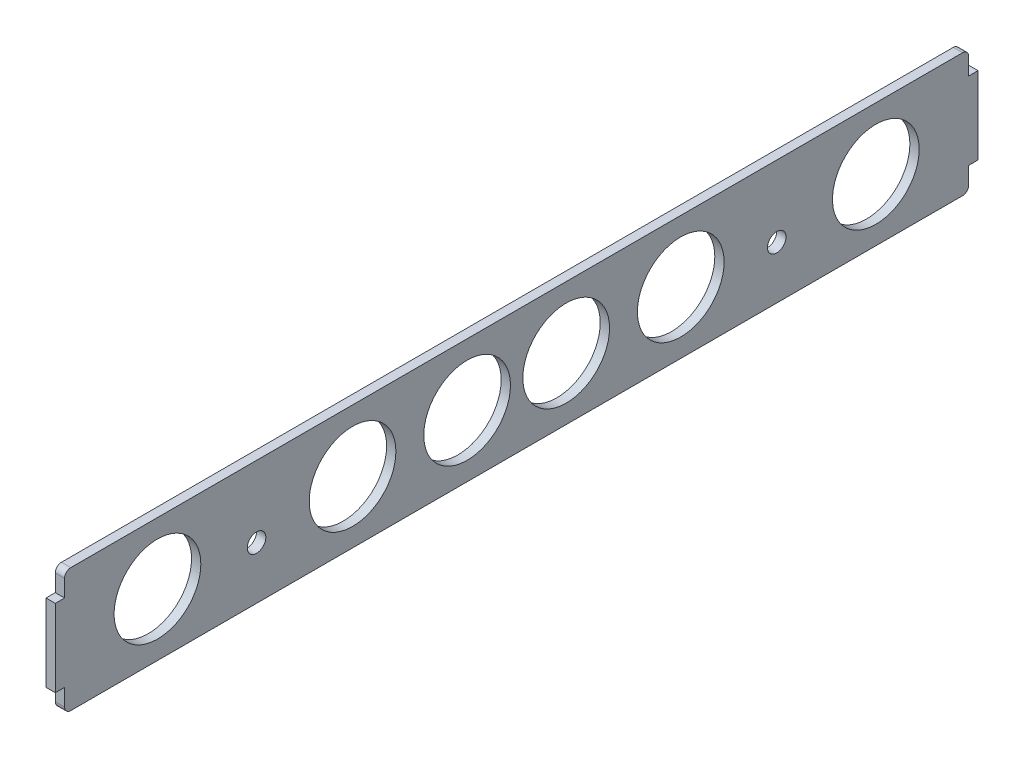
ISO-10303-21;
HEADER;
FILE_DESCRIPTION(('STEP AP214'),'2;1');
FILE_NAME('part.step','',(''),(''),'','','');
FILE_SCHEMA(('AUTOMOTIVE_DESIGN { 1 0 10303 214 1 1 1 1 }'));
ENDSEC;
DATA;
#1=APPLICATION_CONTEXT('core data for automotive mechanical design processes');
#2=APPLICATION_PROTOCOL_DEFINITION('international standard','automotive_design',2000,#1);
#3=PRODUCT_CONTEXT('',#1,'mechanical');
#4=PRODUCT('Part','Part','',(#3));
#5=PRODUCT_RELATED_PRODUCT_CATEGORY('part','',(#4));
#6=PRODUCT_DEFINITION_FORMATION('','',#4);
#7=PRODUCT_DEFINITION_CONTEXT('part definition',#1,'design');
#8=PRODUCT_DEFINITION('design','',#6,#7);
#9=PRODUCT_DEFINITION_SHAPE('','',#8);
#10=(LENGTH_UNIT() NAMED_UNIT(*) SI_UNIT(.MILLI.,.METRE.));
#11=(NAMED_UNIT(*) PLANE_ANGLE_UNIT() SI_UNIT($,.RADIAN.));
#12=(NAMED_UNIT(*) SI_UNIT($,.STERADIAN.) SOLID_ANGLE_UNIT());
#13=UNCERTAINTY_MEASURE_WITH_UNIT(LENGTH_MEASURE(1.E-05),#10,'distance_accuracy_value','');
#14=(GEOMETRIC_REPRESENTATION_CONTEXT(3) GLOBAL_UNCERTAINTY_ASSIGNED_CONTEXT((#13)) GLOBAL_UNIT_ASSIGNED_CONTEXT((#10,
#11,#12)) REPRESENTATION_CONTEXT('',''));
#15=CARTESIAN_POINT('',(0.,0.,0.));
#16=DIRECTION('',(0.,0.,1.));
#17=DIRECTION('',(1.,0.,0.));
#18=AXIS2_PLACEMENT_3D('',#15,#16,#17);
#19=CARTESIAN_POINT('',(3.,0.,-292.));
#20=DIRECTION('',(0.,0.,-1.));
#21=DIRECTION('',(-1.,0.,0.));
#22=AXIS2_PLACEMENT_3D('',#19,#20,#21);
#23=PLANE('',#22);
#24=DIRECTION('',(1.,0.,0.));
#25=VECTOR('',#24,1.);
#26=CARTESIAN_POINT('',(0.,-7.50000000000001,-292.));
#27=LINE('',#26,#25);
#28=CARTESIAN_POINT('',(0.,-7.50000000000001,-292.));
#29=VERTEX_POINT('',#28);
#30=CARTESIAN_POINT('',(3.,-7.50000000000001,-292.));
#31=VERTEX_POINT('',#30);
#32=EDGE_CURVE('E193',#29,#31,#27,.T.);
#33=ORIENTED_EDGE('',*,*,#32,.F.);
#34=DIRECTION('',(0.,-1.,0.));
#35=VECTOR('',#34,1.);
#36=CARTESIAN_POINT('',(0.,0.,-292.));
#37=LINE('',#36,#35);
#38=CARTESIAN_POINT('',(0.,-2.,-292.));
#39=VERTEX_POINT('',#38);
#40=EDGE_CURVE('E297',#39,#29,#37,.T.);
#41=ORIENTED_EDGE('',*,*,#40,.F.);
#42=DIRECTION('',(-1.,0.,0.));
#43=VECTOR('',#42,1.);
#44=CARTESIAN_POINT('',(3.,-2.,-292.));
#45=LINE('',#44,#43);
#46=CARTESIAN_POINT('',(3.,-2.,-292.));
#47=VERTEX_POINT('',#46);
#48=EDGE_CURVE('E333',#39,#47,#45,.F.);
#49=ORIENTED_EDGE('',*,*,#48,.T.);
#50=DIRECTION('',(0.,-1.,0.));
#51=VECTOR('',#50,1.);
#52=CARTESIAN_POINT('',(3.,0.,-292.));
#53=LINE('',#52,#51);
#54=EDGE_CURVE('E271',#47,#31,#53,.T.);
#55=ORIENTED_EDGE('',*,*,#54,.T.);
#56=EDGE_LOOP('',(#33,#41,#49,#55));
#57=FACE_BOUND('',#56,.T.);
#58=ADVANCED_FACE('F41',(#57),#23,.T.);
#59=CARTESIAN_POINT('',(3.,0.,0.));
#60=DIRECTION('',(0.,0.,-1.));
#61=DIRECTION('',(-1.,0.,0.));
#62=AXIS2_PLACEMENT_3D('',#59,#60,#61);
#63=PLANE('',#62);
#64=DIRECTION('',(0.,-1.,0.));
#65=VECTOR('',#64,1.);
#66=CARTESIAN_POINT('',(3.,0.,0.));
#67=LINE('',#66,#65);
#68=CARTESIAN_POINT('',(3.,-32.5,0.));
#69=VERTEX_POINT('',#68);
#70=CARTESIAN_POINT('',(3.,-38.,0.));
#71=VERTEX_POINT('',#70);
#72=EDGE_CURVE('E66',#69,#71,#67,.T.);
#73=ORIENTED_EDGE('',*,*,#72,.F.);
#74=DIRECTION('',(1.,0.,0.));
#75=VECTOR('',#74,1.);
#76=CARTESIAN_POINT('',(0.,-32.5,0.));
#77=LINE('',#76,#75);
#78=CARTESIAN_POINT('',(0.,-32.5,0.));
#79=VERTEX_POINT('',#78);
#80=EDGE_CURVE('E225',#79,#69,#77,.T.);
#81=ORIENTED_EDGE('',*,*,#80,.F.);
#82=DIRECTION('',(0.,-1.,0.));
#83=VECTOR('',#82,1.);
#84=CARTESIAN_POINT('',(0.,0.,0.));
#85=LINE('',#84,#83);
#86=CARTESIAN_POINT('',(0.,-38.,0.));
#87=VERTEX_POINT('',#86);
#88=EDGE_CURVE('E303',#79,#87,#85,.T.);
#89=ORIENTED_EDGE('',*,*,#88,.T.);
#90=DIRECTION('',(-1.,0.,0.));
#91=VECTOR('',#90,1.);
#92=CARTESIAN_POINT('',(3.,-38.,0.));
#93=LINE('',#92,#91);
#94=EDGE_CURVE('E11',#87,#71,#93,.F.);
#95=ORIENTED_EDGE('',*,*,#94,.T.);
#96=EDGE_LOOP('',(#73,#81,#89,#95));
#97=FACE_BOUND('',#96,.T.);
#98=ADVANCED_FACE('F401',(#97),#63,.F.);
#99=DIRECTION('',(1.,0.,0.));
#100=VECTOR('',#99,1.);
#101=CARTESIAN_POINT('',(0.,-32.5,-292.));
#102=LINE('',#101,#100);
#103=CARTESIAN_POINT('',(0.,-32.5,-292.));
#104=VERTEX_POINT('',#103);
#105=CARTESIAN_POINT('',(3.,-32.5,-292.));
#106=VERTEX_POINT('',#105);
#107=EDGE_CURVE('E168',#104,#106,#102,.T.);
#108=ORIENTED_EDGE('',*,*,#107,.T.);
#109=CARTESIAN_POINT('',(3.,-38.,-292.));
#110=VERTEX_POINT('',#109);
#111=EDGE_CURVE('E270',#106,#110,#53,.T.);
#112=ORIENTED_EDGE('',*,*,#111,.T.);
#113=DIRECTION('',(-1.,0.,0.));
#114=VECTOR('',#113,1.);
#115=CARTESIAN_POINT('',(0.,-38.,-292.));
#116=LINE('',#115,#114);
#117=CARTESIAN_POINT('',(0.,-38.,-292.));
#118=VERTEX_POINT('',#117);
#119=EDGE_CURVE('E329',#110,#118,#116,.T.);
#120=ORIENTED_EDGE('',*,*,#119,.T.);
#121=EDGE_CURVE('E296',#104,#118,#37,.T.);
#122=ORIENTED_EDGE('',*,*,#121,.F.);
#123=EDGE_LOOP('',(#108,#112,#120,#122));
#124=FACE_BOUND('',#123,.T.);
#125=ADVANCED_FACE('F404',(#124),#23,.T.);
#126=CARTESIAN_POINT('',(3.,0.,0.));
#127=DIRECTION('',(0.,1.,0.));
#128=DIRECTION('',(0.,0.,1.));
#129=AXIS2_PLACEMENT_3D('',#126,#127,#128);
#130=PLANE('',#129);
#131=DIRECTION('',(0.,0.,-1.));
#132=VECTOR('',#131,1.);
#133=CARTESIAN_POINT('',(3.,0.,0.));
#134=LINE('',#133,#132);
#135=CARTESIAN_POINT('',(3.,0.,-2.));
#136=VERTEX_POINT('',#135);
#137=CARTESIAN_POINT('',(3.,0.,-290.));
#138=VERTEX_POINT('',#137);
#139=EDGE_CURVE('E275',#136,#138,#134,.T.);
#140=ORIENTED_EDGE('',*,*,#139,.T.);
#141=DIRECTION('',(-1.,0.,0.));
#142=VECTOR('',#141,1.);
#143=CARTESIAN_POINT('',(3.,0.,-290.));
#144=LINE('',#143,#142);
#145=CARTESIAN_POINT('',(0.,0.,-290.));
#146=VERTEX_POINT('',#145);
#147=EDGE_CURVE('E312',#138,#146,#144,.T.);
#148=ORIENTED_EDGE('',*,*,#147,.T.);
#149=DIRECTION('',(0.,0.,-1.));
#150=VECTOR('',#149,1.);
#151=CARTESIAN_POINT('',(0.,0.,0.));
#152=LINE('',#151,#150);
#153=CARTESIAN_POINT('',(0.,0.,-2.));
#154=VERTEX_POINT('',#153);
#155=EDGE_CURVE('E300',#154,#146,#152,.T.);
#156=ORIENTED_EDGE('',*,*,#155,.F.);
#157=DIRECTION('',(-1.,0.,0.));
#158=VECTOR('',#157,1.);
#159=CARTESIAN_POINT('',(3.,0.,-2.));
#160=LINE('',#159,#158);
#161=EDGE_CURVE('E287',#154,#136,#160,.F.);
#162=ORIENTED_EDGE('',*,*,#161,.T.);
#163=EDGE_LOOP('',(#140,#148,#156,#162));
#164=FACE_BOUND('',#163,.T.);
#165=ADVANCED_FACE('F414',(#164),#130,.T.);
#166=CARTESIAN_POINT('',(0.,-2.,0.));
#167=VERTEX_POINT('',#166);
#168=CARTESIAN_POINT('',(0.,-7.5,0.));
#169=VERTEX_POINT('',#168);
#170=EDGE_CURVE('E304',#167,#169,#85,.T.);
#171=ORIENTED_EDGE('',*,*,#170,.T.);
#172=DIRECTION('',(1.,0.,0.));
#173=VECTOR('',#172,1.);
#174=CARTESIAN_POINT('',(0.,-7.5,0.));
#175=LINE('',#174,#173);
#176=CARTESIAN_POINT('',(3.,-7.5,0.));
#177=VERTEX_POINT('',#176);
#178=EDGE_CURVE('E214',#169,#177,#175,.T.);
#179=ORIENTED_EDGE('',*,*,#178,.T.);
#180=CARTESIAN_POINT('',(3.,-2.,0.));
#181=VERTEX_POINT('',#180);
#182=EDGE_CURVE('E279',#181,#177,#67,.T.);
#183=ORIENTED_EDGE('',*,*,#182,.F.);
#184=DIRECTION('',(-1.,0.,0.));
#185=VECTOR('',#184,1.);
#186=CARTESIAN_POINT('',(0.,-2.,0.));
#187=LINE('',#186,#185);
#188=EDGE_CURVE('E51',#181,#167,#187,.T.);
#189=ORIENTED_EDGE('',*,*,#188,.T.);
#190=EDGE_LOOP('',(#171,#179,#183,#189));
#191=FACE_BOUND('',#190,.T.);
#192=ADVANCED_FACE('F409',(#191),#63,.F.);
#193=CARTESIAN_POINT('',(3.,-23.,-62.));
#194=DIRECTION('',(-1.,0.,0.));
#195=DIRECTION('',(0.,0.,1.));
#196=AXIS2_PLACEMENT_3D('',#193,#194,#195);
#197=CYLINDRICAL_SURFACE('',#196,3.00000000000001);
#198=CARTESIAN_POINT('',(3.,-23.,-62.));
#199=DIRECTION('',(1.,0.,0.));
#200=DIRECTION('',(0.,0.,-1.));
#201=AXIS2_PLACEMENT_3D('',#198,#199,#200);
#202=CIRCLE('',#201,3.00000000000001);
#203=CARTESIAN_POINT('',(3.,-23.,-65.));
#204=VERTEX_POINT('',#203);
#205=EDGE_CURVE('E265',#204,#204,#202,.T.);
#206=ORIENTED_EDGE('',*,*,#205,.T.);
#207=EDGE_LOOP('',(#206));
#208=FACE_BOUND('',#207,.T.);
#209=CARTESIAN_POINT('',(0.,-23.,-62.));
#210=DIRECTION('',(1.,0.,0.));
#211=DIRECTION('',(0.,0.,-1.));
#212=AXIS2_PLACEMENT_3D('',#209,#210,#211);
#213=CIRCLE('',#212,3.00000000000001);
#214=CARTESIAN_POINT('',(0.,-23.,-65.));
#215=VERTEX_POINT('',#214);
#216=EDGE_CURVE('E292',#215,#215,#213,.T.);
#217=ORIENTED_EDGE('',*,*,#216,.F.);
#218=EDGE_LOOP('',(#217));
#219=FACE_BOUND('',#218,.T.);
#220=ADVANCED_FACE('F543',(#208,#219),#197,.F.);
#221=CARTESIAN_POINT('',(3.,-23.,-230.));
#222=DIRECTION('',(-1.,0.,0.));
#223=DIRECTION('',(0.,0.,1.));
#224=AXIS2_PLACEMENT_3D('',#221,#222,#223);
#225=CYLINDRICAL_SURFACE('',#224,2.99999999999999);
#226=CARTESIAN_POINT('',(3.,-23.,-230.));
#227=DIRECTION('',(1.,0.,0.));
#228=DIRECTION('',(0.,0.,-1.));
#229=AXIS2_PLACEMENT_3D('',#226,#227,#228);
#230=CIRCLE('',#229,2.99999999999999);
#231=CARTESIAN_POINT('',(3.,-23.,-233.));
#232=VERTEX_POINT('',#231);
#233=EDGE_CURVE('E261',#232,#232,#230,.T.);
#234=ORIENTED_EDGE('',*,*,#233,.T.);
#235=EDGE_LOOP('',(#234));
#236=FACE_BOUND('',#235,.T.);
#237=CARTESIAN_POINT('',(0.,-23.,-230.));
#238=DIRECTION('',(1.,0.,0.));
#239=DIRECTION('',(0.,0.,-1.));
#240=AXIS2_PLACEMENT_3D('',#237,#238,#239);
#241=CIRCLE('',#240,2.99999999999999);
#242=CARTESIAN_POINT('',(0.,-23.,-233.));
#243=VERTEX_POINT('',#242);
#244=EDGE_CURVE('E288',#243,#243,#241,.T.);
#245=ORIENTED_EDGE('',*,*,#244,.F.);
#246=EDGE_LOOP('',(#245));
#247=FACE_BOUND('',#246,.T.);
#248=ADVANCED_FACE('F646',(#236,#247),#225,.F.);
#249=CARTESIAN_POINT('',(3.,-40.,0.));
#250=DIRECTION('',(0.,1.,0.));
#251=DIRECTION('',(0.,0.,1.));
#252=AXIS2_PLACEMENT_3D('',#249,#250,#251);
#253=PLANE('',#252);
#254=DIRECTION('',(0.,0.,-1.));
#255=VECTOR('',#254,1.);
#256=CARTESIAN_POINT('',(0.,-40.,0.));
#257=LINE('',#256,#255);
#258=CARTESIAN_POINT('',(0.,-40.,-2.));
#259=VERTEX_POINT('',#258);
#260=CARTESIAN_POINT('',(0.,-40.,-290.));
#261=VERTEX_POINT('',#260);
#262=EDGE_CURVE('E266',#259,#261,#257,.T.);
#263=ORIENTED_EDGE('',*,*,#262,.T.);
#264=DIRECTION('',(-1.,0.,0.));
#265=VECTOR('',#264,1.);
#266=CARTESIAN_POINT('',(3.,-40.,-290.));
#267=LINE('',#266,#265);
#268=CARTESIAN_POINT('',(3.,-40.,-290.));
#269=VERTEX_POINT('',#268);
#270=EDGE_CURVE('E353',#261,#269,#267,.F.);
#271=ORIENTED_EDGE('',*,*,#270,.T.);
#272=DIRECTION('',(0.,0.,-1.));
#273=VECTOR('',#272,1.);
#274=CARTESIAN_POINT('',(3.,-40.,0.));
#275=LINE('',#274,#273);
#276=CARTESIAN_POINT('',(3.,-40.,-2.));
#277=VERTEX_POINT('',#276);
#278=EDGE_CURVE('E283',#277,#269,#275,.T.);
#279=ORIENTED_EDGE('',*,*,#278,.F.);
#280=DIRECTION('',(-1.,0.,0.));
#281=VECTOR('',#280,1.);
#282=CARTESIAN_POINT('',(3.,-40.,-2.));
#283=LINE('',#282,#281);
#284=EDGE_CURVE('E349',#277,#259,#283,.T.);
#285=ORIENTED_EDGE('',*,*,#284,.T.);
#286=EDGE_LOOP('',(#263,#271,#279,#285));
#287=FACE_BOUND('',#286,.T.);
#288=ADVANCED_FACE('F436',(#287),#253,.F.);
#289=CARTESIAN_POINT('',(3.,0.,0.));
#290=DIRECTION('',(1.,0.,0.));
#291=DIRECTION('',(0.,0.,-1.));
#292=AXIS2_PLACEMENT_3D('',#289,#290,#291);
#293=PLANE('',#292);
#294=CARTESIAN_POINT('',(3.,-20.,-30.));
#295=DIRECTION('',(1.,0.,0.));
#296=DIRECTION('',(0.,0.,-1.));
#297=AXIS2_PLACEMENT_3D('',#294,#295,#296);
#298=CIRCLE('',#297,14.);
#299=CARTESIAN_POINT('',(3.,-20.,-44.));
#300=VERTEX_POINT('',#299);
#301=EDGE_CURVE('E237',#300,#300,#298,.T.);
#302=ORIENTED_EDGE('',*,*,#301,.F.);
#303=EDGE_LOOP('',(#302));
#304=FACE_BOUND('',#303,.T.);
#305=CARTESIAN_POINT('',(3.,-20.,-93.));
#306=DIRECTION('',(1.,0.,0.));
#307=DIRECTION('',(0.,0.,-1.));
#308=AXIS2_PLACEMENT_3D('',#305,#306,#307);
#309=CIRCLE('',#308,14.);
#310=CARTESIAN_POINT('',(3.,-20.,-107.));
#311=VERTEX_POINT('',#310);
#312=EDGE_CURVE('E242',#311,#311,#309,.T.);
#313=ORIENTED_EDGE('',*,*,#312,.F.);
#314=EDGE_LOOP('',(#313));
#315=FACE_BOUND('',#314,.T.);
#316=CARTESIAN_POINT('',(3.,-20.,-130.));
#317=DIRECTION('',(1.,0.,0.));
#318=DIRECTION('',(0.,0.,-1.));
#319=AXIS2_PLACEMENT_3D('',#316,#317,#318);
#320=CIRCLE('',#319,14.);
#321=CARTESIAN_POINT('',(3.,-20.,-144.));
#322=VERTEX_POINT('',#321);
#323=EDGE_CURVE('E246',#322,#322,#320,.T.);
#324=ORIENTED_EDGE('',*,*,#323,.F.);
#325=EDGE_LOOP('',(#324));
#326=FACE_BOUND('',#325,.T.);
#327=CARTESIAN_POINT('',(3.,-20.,-199.));
#328=DIRECTION('',(1.,0.,0.));
#329=DIRECTION('',(0.,0.,-1.));
#330=AXIS2_PLACEMENT_3D('',#327,#328,#329);
#331=CIRCLE('',#330,14.);
#332=CARTESIAN_POINT('',(3.,-20.,-213.));
#333=VERTEX_POINT('',#332);
#334=EDGE_CURVE('E250',#333,#333,#331,.T.);
#335=ORIENTED_EDGE('',*,*,#334,.F.);
#336=EDGE_LOOP('',(#335));
#337=FACE_BOUND('',#336,.T.);
#338=CARTESIAN_POINT('',(3.,-20.,-162.));
#339=DIRECTION('',(1.,0.,0.));
#340=DIRECTION('',(0.,0.,-1.));
#341=AXIS2_PLACEMENT_3D('',#338,#339,#340);
#342=CIRCLE('',#341,14.);
#343=CARTESIAN_POINT('',(3.,-20.,-176.));
#344=VERTEX_POINT('',#343);
#345=EDGE_CURVE('E254',#344,#344,#342,.T.);
#346=ORIENTED_EDGE('',*,*,#345,.F.);
#347=EDGE_LOOP('',(#346));
#348=FACE_BOUND('',#347,.T.);
#349=CARTESIAN_POINT('',(3.,-20.,-262.));
#350=DIRECTION('',(1.,0.,0.));
#351=DIRECTION('',(0.,0.,-1.));
#352=AXIS2_PLACEMENT_3D('',#349,#350,#351);
#353=CIRCLE('',#352,14.);
#354=CARTESIAN_POINT('',(3.,-20.,-276.));
#355=VERTEX_POINT('',#354);
#356=EDGE_CURVE('E228',#355,#355,#353,.T.);
#357=ORIENTED_EDGE('',*,*,#356,.F.);
#358=EDGE_LOOP('',(#357));
#359=FACE_BOUND('',#358,.T.);
#360=ORIENTED_EDGE('',*,*,#233,.F.);
#361=EDGE_LOOP('',(#360));
#362=FACE_BOUND('',#361,.T.);
#363=ORIENTED_EDGE('',*,*,#205,.F.);
#364=EDGE_LOOP('',(#363));
#365=FACE_BOUND('',#364,.T.);
#366=ORIENTED_EDGE('',*,*,#54,.F.);
#367=CARTESIAN_POINT('',(3.,-2.,-290.));
#368=DIRECTION('',(1.,0.,0.));
#369=DIRECTION('',(0.,0.,-1.));
#370=AXIS2_PLACEMENT_3D('',#367,#368,#369);
#371=CIRCLE('',#370,2.);
#372=EDGE_CURVE('E346',#47,#138,#371,.T.);
#373=ORIENTED_EDGE('',*,*,#372,.T.);
#374=ORIENTED_EDGE('',*,*,#139,.F.);
#375=CARTESIAN_POINT('',(3.,-2.,-2.));
#376=DIRECTION('',(1.,0.,0.));
#377=DIRECTION('',(0.,0.,-1.));
#378=AXIS2_PLACEMENT_3D('',#375,#376,#377);
#379=CIRCLE('',#378,2.);
#380=EDGE_CURVE('E336',#136,#181,#379,.T.);
#381=ORIENTED_EDGE('',*,*,#380,.T.);
#382=ORIENTED_EDGE('',*,*,#182,.T.);
#383=DIRECTION('',(0.,0.,1.));
#384=VECTOR('',#383,1.);
#385=CARTESIAN_POINT('',(3.,-7.5,0.));
#386=LINE('',#385,#384);
#387=CARTESIAN_POINT('',(3.,-7.5,2.99999999999999));
#388=VERTEX_POINT('',#387);
#389=EDGE_CURVE('E196',#177,#388,#386,.T.);
#390=ORIENTED_EDGE('',*,*,#389,.T.);
#391=DIRECTION('',(0.,-1.,0.));
#392=VECTOR('',#391,1.);
#393=CARTESIAN_POINT('',(3.,-7.5,2.99999999999999));
#394=LINE('',#393,#392);
#395=CARTESIAN_POINT('',(3.,-32.5,3.));
#396=VERTEX_POINT('',#395);
#397=EDGE_CURVE('E218',#388,#396,#394,.T.);
#398=ORIENTED_EDGE('',*,*,#397,.T.);
#399=DIRECTION('',(0.,0.,-1.));
#400=VECTOR('',#399,1.);
#401=CARTESIAN_POINT('',(3.,-32.5,0.));
#402=LINE('',#401,#400);
#403=EDGE_CURVE('E206',#396,#69,#402,.T.);
#404=ORIENTED_EDGE('',*,*,#403,.T.);
#405=ORIENTED_EDGE('',*,*,#72,.T.);
#406=CARTESIAN_POINT('',(3.,-38.,-2.));
#407=DIRECTION('',(1.,0.,0.));
#408=DIRECTION('',(0.,0.,-1.));
#409=AXIS2_PLACEMENT_3D('',#406,#407,#408);
#410=CIRCLE('',#409,2.);
#411=EDGE_CURVE('E339',#71,#277,#410,.T.);
#412=ORIENTED_EDGE('',*,*,#411,.T.);
#413=ORIENTED_EDGE('',*,*,#278,.T.);
#414=CARTESIAN_POINT('',(3.,-38.,-290.));
#415=DIRECTION('',(1.,0.,0.));
#416=DIRECTION('',(0.,0.,-1.));
#417=AXIS2_PLACEMENT_3D('',#414,#415,#416);
#418=CIRCLE('',#417,2.);
#419=EDGE_CURVE('E342',#269,#110,#418,.T.);
#420=ORIENTED_EDGE('',*,*,#419,.T.);
#421=ORIENTED_EDGE('',*,*,#111,.F.);
#422=DIRECTION('',(0.,0.,-1.));
#423=VECTOR('',#422,1.);
#424=CARTESIAN_POINT('',(3.,-32.5,-292.));
#425=LINE('',#424,#423);
#426=CARTESIAN_POINT('',(3.,-32.5,-295.));
#427=VERTEX_POINT('',#426);
#428=EDGE_CURVE('E188',#106,#427,#425,.T.);
#429=ORIENTED_EDGE('',*,*,#428,.T.);
#430=DIRECTION('',(0.,1.,0.));
#431=VECTOR('',#430,1.);
#432=CARTESIAN_POINT('',(3.,-7.5,-295.));
#433=LINE('',#432,#431);
#434=CARTESIAN_POINT('',(3.,-7.5,-295.));
#435=VERTEX_POINT('',#434);
#436=EDGE_CURVE('E163',#427,#435,#433,.T.);
#437=ORIENTED_EDGE('',*,*,#436,.T.);
#438=DIRECTION('',(0.,0.,1.));
#439=VECTOR('',#438,1.);
#440=CARTESIAN_POINT('',(3.,-7.50000000000001,-292.));
#441=LINE('',#440,#439);
#442=EDGE_CURVE('E180',#435,#31,#441,.T.);
#443=ORIENTED_EDGE('',*,*,#442,.T.);
#444=EDGE_LOOP('',(#366,#373,#374,#381,#382,#390,#398,#404,#405,#412,#413,#420,#421,#429,#437,#443));
#445=FACE_BOUND('',#444,.T.);
#446=ADVANCED_FACE('F423',(#304,#315,#326,#337,#348,#359,#362,#365,#445),#293,.T.);
#447=CARTESIAN_POINT('',(0.,0.,0.));
#448=DIRECTION('',(1.,0.,0.));
#449=DIRECTION('',(0.,0.,-1.));
#450=AXIS2_PLACEMENT_3D('',#447,#448,#449);
#451=PLANE('',#450);
#452=CARTESIAN_POINT('',(0.,-20.,-30.));
#453=DIRECTION('',(1.,0.,0.));
#454=DIRECTION('',(0.,0.,-1.));
#455=AXIS2_PLACEMENT_3D('',#452,#453,#454);
#456=CIRCLE('',#455,14.);
#457=CARTESIAN_POINT('',(0.,-20.,-44.));
#458=VERTEX_POINT('',#457);
#459=EDGE_CURVE('E45',#458,#458,#456,.T.);
#460=ORIENTED_EDGE('',*,*,#459,.T.);
#461=EDGE_LOOP('',(#460));
#462=FACE_BOUND('',#461,.T.);
#463=CARTESIAN_POINT('',(0.,-20.,-93.));
#464=DIRECTION('',(1.,0.,0.));
#465=DIRECTION('',(0.,0.,-1.));
#466=AXIS2_PLACEMENT_3D('',#463,#464,#465);
#467=CIRCLE('',#466,14.);
#468=CARTESIAN_POINT('',(0.,-20.,-107.));
#469=VERTEX_POINT('',#468);
#470=EDGE_CURVE('E373',#469,#469,#467,.T.);
#471=ORIENTED_EDGE('',*,*,#470,.T.);
#472=EDGE_LOOP('',(#471));
#473=FACE_BOUND('',#472,.T.);
#474=CARTESIAN_POINT('',(0.,-20.,-130.));
#475=DIRECTION('',(1.,0.,0.));
#476=DIRECTION('',(0.,0.,-1.));
#477=AXIS2_PLACEMENT_3D('',#474,#475,#476);
#478=CIRCLE('',#477,14.);
#479=CARTESIAN_POINT('',(0.,-20.,-144.));
#480=VERTEX_POINT('',#479);
#481=EDGE_CURVE('E370',#480,#480,#478,.T.);
#482=ORIENTED_EDGE('',*,*,#481,.T.);
#483=EDGE_LOOP('',(#482));
#484=FACE_BOUND('',#483,.T.);
#485=CARTESIAN_POINT('',(0.,-20.,-199.));
#486=DIRECTION('',(1.,0.,0.));
#487=DIRECTION('',(0.,0.,-1.));
#488=AXIS2_PLACEMENT_3D('',#485,#486,#487);
#489=CIRCLE('',#488,14.);
#490=CARTESIAN_POINT('',(0.,-20.,-213.));
#491=VERTEX_POINT('',#490);
#492=EDGE_CURVE('E366',#491,#491,#489,.T.);
#493=ORIENTED_EDGE('',*,*,#492,.T.);
#494=EDGE_LOOP('',(#493));
#495=FACE_BOUND('',#494,.T.);
#496=CARTESIAN_POINT('',(0.,-20.,-162.));
#497=DIRECTION('',(1.,0.,0.));
#498=DIRECTION('',(0.,0.,-1.));
#499=AXIS2_PLACEMENT_3D('',#496,#497,#498);
#500=CIRCLE('',#499,14.);
#501=CARTESIAN_POINT('',(0.,-20.,-176.));
#502=VERTEX_POINT('',#501);
#503=EDGE_CURVE('E362',#502,#502,#500,.T.);
#504=ORIENTED_EDGE('',*,*,#503,.T.);
#505=EDGE_LOOP('',(#504));
#506=FACE_BOUND('',#505,.T.);
#507=CARTESIAN_POINT('',(0.,-20.,-262.));
#508=DIRECTION('',(1.,0.,0.));
#509=DIRECTION('',(0.,0.,-1.));
#510=AXIS2_PLACEMENT_3D('',#507,#508,#509);
#511=CIRCLE('',#510,14.);
#512=CARTESIAN_POINT('',(0.,-20.,-276.));
#513=VERTEX_POINT('',#512);
#514=EDGE_CURVE('E241',#513,#513,#511,.T.);
#515=ORIENTED_EDGE('',*,*,#514,.T.);
#516=EDGE_LOOP('',(#515));
#517=FACE_BOUND('',#516,.T.);
#518=ORIENTED_EDGE('',*,*,#244,.T.);
#519=EDGE_LOOP('',(#518));
#520=FACE_BOUND('',#519,.T.);
#521=ORIENTED_EDGE('',*,*,#216,.T.);
#522=EDGE_LOOP('',(#521));
#523=FACE_BOUND('',#522,.T.);
#524=ORIENTED_EDGE('',*,*,#155,.T.);
#525=CARTESIAN_POINT('',(0.,-2.,-290.));
#526=DIRECTION('',(1.,0.,0.));
#527=DIRECTION('',(0.,0.,-1.));
#528=AXIS2_PLACEMENT_3D('',#525,#526,#527);
#529=CIRCLE('',#528,2.);
#530=EDGE_CURVE('E326',#146,#39,#529,.F.);
#531=ORIENTED_EDGE('',*,*,#530,.T.);
#532=ORIENTED_EDGE('',*,*,#40,.T.);
#533=DIRECTION('',(0.,0.,1.));
#534=VECTOR('',#533,1.);
#535=CARTESIAN_POINT('',(0.,-7.50000000000001,-292.));
#536=LINE('',#535,#534);
#537=CARTESIAN_POINT('',(0.,-7.5,-295.));
#538=VERTEX_POINT('',#537);
#539=EDGE_CURVE('E173',#538,#29,#536,.T.);
#540=ORIENTED_EDGE('',*,*,#539,.F.);
#541=DIRECTION('',(0.,1.,0.));
#542=VECTOR('',#541,1.);
#543=CARTESIAN_POINT('',(0.,-7.5,-295.));
#544=LINE('',#543,#542);
#545=CARTESIAN_POINT('',(0.,-32.5,-295.));
#546=VERTEX_POINT('',#545);
#547=EDGE_CURVE('E160',#546,#538,#544,.T.);
#548=ORIENTED_EDGE('',*,*,#547,.F.);
#549=DIRECTION('',(0.,0.,-1.));
#550=VECTOR('',#549,1.);
#551=CARTESIAN_POINT('',(0.,-32.5,-292.));
#552=LINE('',#551,#550);
#553=EDGE_CURVE('E59',#104,#546,#552,.T.);
#554=ORIENTED_EDGE('',*,*,#553,.F.);
#555=ORIENTED_EDGE('',*,*,#121,.T.);
#556=CARTESIAN_POINT('',(0.,-38.,-290.));
#557=DIRECTION('',(1.,0.,0.));
#558=DIRECTION('',(0.,0.,-1.));
#559=AXIS2_PLACEMENT_3D('',#556,#557,#558);
#560=CIRCLE('',#559,2.);
#561=EDGE_CURVE('E323',#118,#261,#560,.F.);
#562=ORIENTED_EDGE('',*,*,#561,.T.);
#563=ORIENTED_EDGE('',*,*,#262,.F.);
#564=CARTESIAN_POINT('',(0.,-38.,-2.));
#565=DIRECTION('',(1.,0.,0.));
#566=DIRECTION('',(0.,0.,-1.));
#567=AXIS2_PLACEMENT_3D('',#564,#565,#566);
#568=CIRCLE('',#567,2.);
#569=EDGE_CURVE('E319',#259,#87,#568,.F.);
#570=ORIENTED_EDGE('',*,*,#569,.T.);
#571=ORIENTED_EDGE('',*,*,#88,.F.);
#572=DIRECTION('',(0.,0.,-1.));
#573=VECTOR('',#572,1.);
#574=CARTESIAN_POINT('',(0.,-32.5,0.));
#575=LINE('',#574,#573);
#576=CARTESIAN_POINT('',(0.,-32.5,3.));
#577=VERTEX_POINT('',#576);
#578=EDGE_CURVE('E210',#577,#79,#575,.T.);
#579=ORIENTED_EDGE('',*,*,#578,.F.);
#580=DIRECTION('',(0.,-1.,0.));
#581=VECTOR('',#580,1.);
#582=CARTESIAN_POINT('',(0.,-7.5,2.99999999999999));
#583=LINE('',#582,#581);
#584=CARTESIAN_POINT('',(0.,-7.5,2.99999999999999));
#585=VERTEX_POINT('',#584);
#586=EDGE_CURVE('E205',#585,#577,#583,.T.);
#587=ORIENTED_EDGE('',*,*,#586,.F.);
#588=DIRECTION('',(0.,0.,1.));
#589=VECTOR('',#588,1.);
#590=CARTESIAN_POINT('',(0.,-7.5,0.));
#591=LINE('',#590,#589);
#592=EDGE_CURVE('E201',#169,#585,#591,.T.);
#593=ORIENTED_EDGE('',*,*,#592,.F.);
#594=ORIENTED_EDGE('',*,*,#170,.F.);
#595=CARTESIAN_POINT('',(0.,-2.,-2.));
#596=DIRECTION('',(1.,0.,0.));
#597=DIRECTION('',(0.,0.,-1.));
#598=AXIS2_PLACEMENT_3D('',#595,#596,#597);
#599=CIRCLE('',#598,2.);
#600=EDGE_CURVE('E316',#167,#154,#599,.F.);
#601=ORIENTED_EDGE('',*,*,#600,.T.);
#602=EDGE_LOOP('',(#524,#531,#532,#540,#548,#554,#555,#562,#563,#570,#571,#579,#587,#593,#594,#601));
#603=FACE_BOUND('',#602,.T.);
#604=ADVANCED_FACE('F171',(#462,#473,#484,#495,#506,#517,#520,#523,#603),#451,.F.);
#605=CARTESIAN_POINT('',(3.,-2.,-290.));
#606=DIRECTION('',(-1.,0.,0.));
#607=DIRECTION('',(0.,0.,1.));
#608=AXIS2_PLACEMENT_3D('',#605,#606,#607);
#609=CYLINDRICAL_SURFACE('',#608,2.);
#610=ORIENTED_EDGE('',*,*,#372,.F.);
#611=ORIENTED_EDGE('',*,*,#48,.F.);
#612=ORIENTED_EDGE('',*,*,#530,.F.);
#613=ORIENTED_EDGE('',*,*,#147,.F.);
#614=EDGE_LOOP('',(#610,#611,#612,#613));
#615=FACE_BOUND('',#614,.T.);
#616=ADVANCED_FACE('F464',(#615),#609,.T.);
#617=CARTESIAN_POINT('',(3.,-38.,-290.));
#618=DIRECTION('',(1.,0.,0.));
#619=DIRECTION('',(0.,0.,-1.));
#620=AXIS2_PLACEMENT_3D('',#617,#618,#619);
#621=CYLINDRICAL_SURFACE('',#620,2.);
#622=ORIENTED_EDGE('',*,*,#419,.F.);
#623=ORIENTED_EDGE('',*,*,#270,.F.);
#624=ORIENTED_EDGE('',*,*,#561,.F.);
#625=ORIENTED_EDGE('',*,*,#119,.F.);
#626=EDGE_LOOP('',(#622,#623,#624,#625));
#627=FACE_BOUND('',#626,.T.);
#628=ADVANCED_FACE('F433',(#627),#621,.T.);
#629=CARTESIAN_POINT('',(3.,-38.,-2.));
#630=DIRECTION('',(-1.,0.,0.));
#631=DIRECTION('',(0.,0.,1.));
#632=AXIS2_PLACEMENT_3D('',#629,#630,#631);
#633=CYLINDRICAL_SURFACE('',#632,2.);
#634=ORIENTED_EDGE('',*,*,#411,.F.);
#635=ORIENTED_EDGE('',*,*,#94,.F.);
#636=ORIENTED_EDGE('',*,*,#569,.F.);
#637=ORIENTED_EDGE('',*,*,#284,.F.);
#638=EDGE_LOOP('',(#634,#635,#636,#637));
#639=FACE_BOUND('',#638,.T.);
#640=ADVANCED_FACE('F441',(#639),#633,.T.);
#641=CARTESIAN_POINT('',(3.,-2.,-2.));
#642=DIRECTION('',(1.,0.,0.));
#643=DIRECTION('',(0.,0.,-1.));
#644=AXIS2_PLACEMENT_3D('',#641,#642,#643);
#645=CYLINDRICAL_SURFACE('',#644,2.);
#646=ORIENTED_EDGE('',*,*,#380,.F.);
#647=ORIENTED_EDGE('',*,*,#161,.F.);
#648=ORIENTED_EDGE('',*,*,#600,.F.);
#649=ORIENTED_EDGE('',*,*,#188,.F.);
#650=EDGE_LOOP('',(#646,#647,#648,#649));
#651=FACE_BOUND('',#650,.T.);
#652=ADVANCED_FACE('F43',(#651),#645,.T.);
#653=CARTESIAN_POINT('',(-7.,-20.,-262.));
#654=DIRECTION('',(1.,0.,0.));
#655=DIRECTION('',(0.,0.,-1.));
#656=AXIS2_PLACEMENT_3D('',#653,#654,#655);
#657=CYLINDRICAL_SURFACE('',#656,14.);
#658=ORIENTED_EDGE('',*,*,#356,.T.);
#659=EDGE_LOOP('',(#658));
#660=FACE_BOUND('',#659,.T.);
#661=ORIENTED_EDGE('',*,*,#514,.F.);
#662=EDGE_LOOP('',(#661));
#663=FACE_BOUND('',#662,.T.);
#664=ADVANCED_FACE('F599',(#660,#663),#657,.F.);
#665=CARTESIAN_POINT('',(-7.,-20.,-162.));
#666=DIRECTION('',(1.,0.,0.));
#667=DIRECTION('',(0.,0.,-1.));
#668=AXIS2_PLACEMENT_3D('',#665,#666,#667);
#669=CYLINDRICAL_SURFACE('',#668,14.);
#670=ORIENTED_EDGE('',*,*,#345,.T.);
#671=EDGE_LOOP('',(#670));
#672=FACE_BOUND('',#671,.T.);
#673=ORIENTED_EDGE('',*,*,#503,.F.);
#674=EDGE_LOOP('',(#673));
#675=FACE_BOUND('',#674,.T.);
#676=ADVANCED_FACE('F589',(#672,#675),#669,.F.);
#677=CARTESIAN_POINT('',(-7.,-20.,-199.));
#678=DIRECTION('',(1.,0.,0.));
#679=DIRECTION('',(0.,0.,-1.));
#680=AXIS2_PLACEMENT_3D('',#677,#678,#679);
#681=CYLINDRICAL_SURFACE('',#680,14.);
#682=ORIENTED_EDGE('',*,*,#334,.T.);
#683=EDGE_LOOP('',(#682));
#684=FACE_BOUND('',#683,.T.);
#685=ORIENTED_EDGE('',*,*,#492,.F.);
#686=EDGE_LOOP('',(#685));
#687=FACE_BOUND('',#686,.T.);
#688=ADVANCED_FACE('F579',(#684,#687),#681,.F.);
#689=CARTESIAN_POINT('',(-7.,-20.,-130.));
#690=DIRECTION('',(1.,0.,0.));
#691=DIRECTION('',(0.,0.,-1.));
#692=AXIS2_PLACEMENT_3D('',#689,#690,#691);
#693=CYLINDRICAL_SURFACE('',#692,14.);
#694=ORIENTED_EDGE('',*,*,#323,.T.);
#695=EDGE_LOOP('',(#694));
#696=FACE_BOUND('',#695,.T.);
#697=ORIENTED_EDGE('',*,*,#481,.F.);
#698=EDGE_LOOP('',(#697));
#699=FACE_BOUND('',#698,.T.);
#700=ADVANCED_FACE('F396',(#696,#699),#693,.F.);
#701=CARTESIAN_POINT('',(-7.,-20.,-93.));
#702=DIRECTION('',(1.,0.,0.));
#703=DIRECTION('',(0.,0.,-1.));
#704=AXIS2_PLACEMENT_3D('',#701,#702,#703);
#705=CYLINDRICAL_SURFACE('',#704,14.);
#706=ORIENTED_EDGE('',*,*,#312,.T.);
#707=EDGE_LOOP('',(#706));
#708=FACE_BOUND('',#707,.T.);
#709=ORIENTED_EDGE('',*,*,#470,.F.);
#710=EDGE_LOOP('',(#709));
#711=FACE_BOUND('',#710,.T.);
#712=ADVANCED_FACE('F386',(#708,#711),#705,.F.);
#713=CARTESIAN_POINT('',(-7.,-20.,-30.));
#714=DIRECTION('',(1.,0.,0.));
#715=DIRECTION('',(0.,0.,-1.));
#716=AXIS2_PLACEMENT_3D('',#713,#714,#715);
#717=CYLINDRICAL_SURFACE('',#716,14.);
#718=ORIENTED_EDGE('',*,*,#301,.T.);
#719=EDGE_LOOP('',(#718));
#720=FACE_BOUND('',#719,.T.);
#721=ORIENTED_EDGE('',*,*,#459,.F.);
#722=EDGE_LOOP('',(#721));
#723=FACE_BOUND('',#722,.T.);
#724=ADVANCED_FACE('F383',(#720,#723),#717,.F.);
#725=CARTESIAN_POINT('',(0.,-32.5,0.));
#726=DIRECTION('',(0.,-1.,0.));
#727=DIRECTION('',(0.,0.,-1.));
#728=AXIS2_PLACEMENT_3D('',#725,#726,#727);
#729=PLANE('',#728);
#730=ORIENTED_EDGE('',*,*,#403,.F.);
#731=DIRECTION('',(1.,0.,0.));
#732=VECTOR('',#731,1.);
#733=CARTESIAN_POINT('',(0.,-32.5,3.));
#734=LINE('',#733,#732);
#735=EDGE_CURVE('E229',#577,#396,#734,.T.);
#736=ORIENTED_EDGE('',*,*,#735,.F.);
#737=ORIENTED_EDGE('',*,*,#578,.T.);
#738=ORIENTED_EDGE('',*,*,#80,.T.);
#739=EDGE_LOOP('',(#730,#736,#737,#738));
#740=FACE_BOUND('',#739,.T.);
#741=ADVANCED_FACE('F385',(#740),#729,.T.);
#742=CARTESIAN_POINT('',(0.,-7.5,2.99999999999999));
#743=DIRECTION('',(0.,0.,1.));
#744=DIRECTION('',(0.,-1.,0.));
#745=AXIS2_PLACEMENT_3D('',#742,#743,#744);
#746=PLANE('',#745);
#747=ORIENTED_EDGE('',*,*,#397,.F.);
#748=DIRECTION('',(1.,0.,0.));
#749=VECTOR('',#748,1.);
#750=CARTESIAN_POINT('',(0.,-7.5,2.99999999999999));
#751=LINE('',#750,#749);
#752=EDGE_CURVE('E232',#585,#388,#751,.T.);
#753=ORIENTED_EDGE('',*,*,#752,.F.);
#754=ORIENTED_EDGE('',*,*,#586,.T.);
#755=ORIENTED_EDGE('',*,*,#735,.T.);
#756=EDGE_LOOP('',(#747,#753,#754,#755));
#757=FACE_BOUND('',#756,.T.);
#758=ADVANCED_FACE('F393',(#757),#746,.T.);
#759=CARTESIAN_POINT('',(0.,-7.5,0.));
#760=DIRECTION('',(0.,1.,0.));
#761=DIRECTION('',(0.,0.,1.));
#762=AXIS2_PLACEMENT_3D('',#759,#760,#761);
#763=PLANE('',#762);
#764=ORIENTED_EDGE('',*,*,#389,.F.);
#765=ORIENTED_EDGE('',*,*,#178,.F.);
#766=ORIENTED_EDGE('',*,*,#592,.T.);
#767=ORIENTED_EDGE('',*,*,#752,.T.);
#768=EDGE_LOOP('',(#764,#765,#766,#767));
#769=FACE_BOUND('',#768,.T.);
#770=ADVANCED_FACE('F452',(#769),#763,.T.);
#771=CARTESIAN_POINT('',(0.,-7.50000000000001,-292.));
#772=DIRECTION('',(0.,1.,0.));
#773=DIRECTION('',(0.,0.,1.));
#774=AXIS2_PLACEMENT_3D('',#771,#772,#773);
#775=PLANE('',#774);
#776=ORIENTED_EDGE('',*,*,#442,.F.);
#777=DIRECTION('',(1.,0.,0.));
#778=VECTOR('',#777,1.);
#779=CARTESIAN_POINT('',(0.,-7.5,-295.));
#780=LINE('',#779,#778);
#781=EDGE_CURVE('E167',#538,#435,#780,.T.);
#782=ORIENTED_EDGE('',*,*,#781,.F.);
#783=ORIENTED_EDGE('',*,*,#539,.T.);
#784=ORIENTED_EDGE('',*,*,#32,.T.);
#785=EDGE_LOOP('',(#776,#782,#783,#784));
#786=FACE_BOUND('',#785,.T.);
#787=ADVANCED_FACE('F469',(#786),#775,.T.);
#788=CARTESIAN_POINT('',(0.,-7.5,-295.));
#789=DIRECTION('',(0.,0.,-1.));
#790=DIRECTION('',(-1.,0.,0.));
#791=AXIS2_PLACEMENT_3D('',#788,#789,#790);
#792=PLANE('',#791);
#793=ORIENTED_EDGE('',*,*,#436,.F.);
#794=DIRECTION('',(1.,0.,0.));
#795=VECTOR('',#794,1.);
#796=CARTESIAN_POINT('',(0.,-32.5,-295.));
#797=LINE('',#796,#795);
#798=EDGE_CURVE('E158',#546,#427,#797,.T.);
#799=ORIENTED_EDGE('',*,*,#798,.F.);
#800=ORIENTED_EDGE('',*,*,#547,.T.);
#801=ORIENTED_EDGE('',*,*,#781,.T.);
#802=EDGE_LOOP('',(#793,#799,#800,#801));
#803=FACE_BOUND('',#802,.T.);
#804=ADVANCED_FACE('F159',(#803),#792,.T.);
#805=CARTESIAN_POINT('',(0.,-32.5,-292.));
#806=DIRECTION('',(0.,-1.,0.));
#807=DIRECTION('',(0.,0.,-1.));
#808=AXIS2_PLACEMENT_3D('',#805,#806,#807);
#809=PLANE('',#808);
#810=ORIENTED_EDGE('',*,*,#428,.F.);
#811=ORIENTED_EDGE('',*,*,#107,.F.);
#812=ORIENTED_EDGE('',*,*,#553,.T.);
#813=ORIENTED_EDGE('',*,*,#798,.T.);
#814=EDGE_LOOP('',(#810,#811,#812,#813));
#815=FACE_BOUND('',#814,.T.);
#816=ADVANCED_FACE('F176',(#815),#809,.T.);
#817=CLOSED_SHELL('',(#58,#98,#125,#165,#192,#220,#248,#288,#446,#604,#616,#628,#640,#652,#664,
#676,#688,#700,#712,#724,#741,#758,#770,#787,#804,#816));
#818=MANIFOLD_SOLID_BREP('B2',#817);
#819=ADVANCED_BREP_SHAPE_REPRESENTATION('',(#18,#818),#14);
#820=SHAPE_DEFINITION_REPRESENTATION(#9,#819);
ENDSEC;
END-ISO-10303-21;
